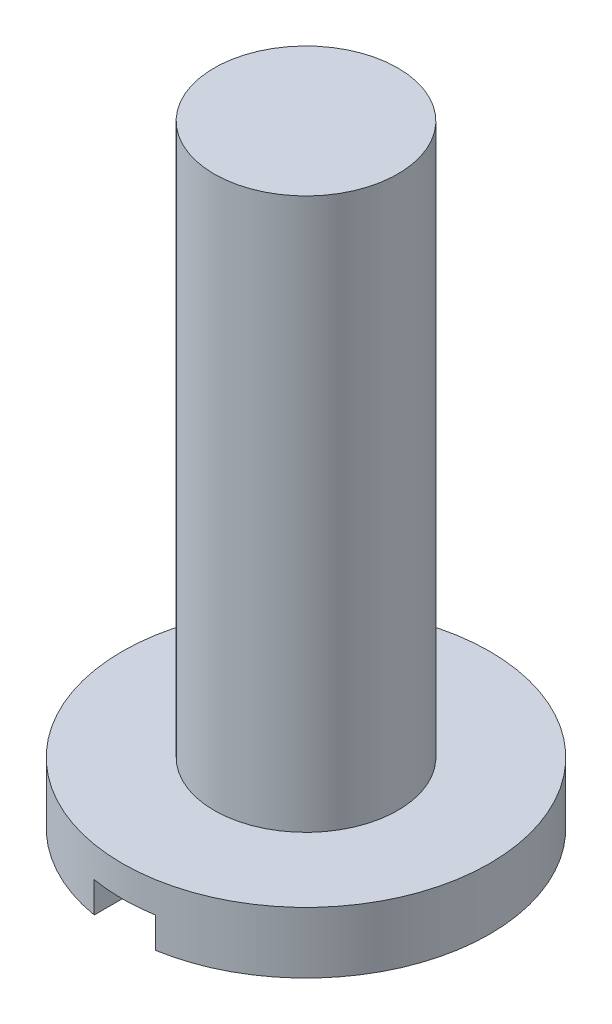
ISO-10303-21;
HEADER;
FILE_DESCRIPTION(('STEP AP214'),'2;1');
FILE_NAME('part.step','',(''),(''),'','','');
FILE_SCHEMA(('AUTOMOTIVE_DESIGN { 1 0 10303 214 1 1 1 1 }'));
ENDSEC;
DATA;
#1=APPLICATION_CONTEXT('core data for automotive mechanical design processes');
#2=APPLICATION_PROTOCOL_DEFINITION('international standard','automotive_design',2000,#1);
#3=PRODUCT_CONTEXT('',#1,'mechanical');
#4=PRODUCT('Part','Part','',(#3));
#5=PRODUCT_RELATED_PRODUCT_CATEGORY('part','',(#4));
#6=PRODUCT_DEFINITION_FORMATION('','',#4);
#7=PRODUCT_DEFINITION_CONTEXT('part definition',#1,'design');
#8=PRODUCT_DEFINITION('design','',#6,#7);
#9=PRODUCT_DEFINITION_SHAPE('','',#8);
#10=(LENGTH_UNIT() NAMED_UNIT(*) SI_UNIT(.MILLI.,.METRE.));
#11=(NAMED_UNIT(*) PLANE_ANGLE_UNIT() SI_UNIT($,.RADIAN.));
#12=(NAMED_UNIT(*) SI_UNIT($,.STERADIAN.) SOLID_ANGLE_UNIT());
#13=UNCERTAINTY_MEASURE_WITH_UNIT(LENGTH_MEASURE(1.E-05),#10,'distance_accuracy_value','');
#14=(GEOMETRIC_REPRESENTATION_CONTEXT(3) GLOBAL_UNCERTAINTY_ASSIGNED_CONTEXT((#13)) GLOBAL_UNIT_ASSIGNED_CONTEXT((#10,
#11,#12)) REPRESENTATION_CONTEXT('',''));
#15=CARTESIAN_POINT('',(0.,0.,0.));
#16=DIRECTION('',(0.,0.,1.));
#17=DIRECTION('',(1.,0.,0.));
#18=AXIS2_PLACEMENT_3D('',#15,#16,#17);
#19=CARTESIAN_POINT('',(0.,0.,0.));
#20=DIRECTION('',(0.,-1.,0.));
#21=DIRECTION('',(0.,0.,-1.));
#22=AXIS2_PLACEMENT_3D('',#19,#20,#21);
#23=PLANE('',#22);
#24=DIRECTION('',(0.,0.,-1.));
#25=VECTOR('',#24,1.);
#26=CARTESIAN_POINT('',(-0.500000000000001,0.,3.));
#27=LINE('',#26,#25);
#28=CARTESIAN_POINT('',(-0.500000000000001,0.,2.95803989154981));
#29=VERTEX_POINT('',#28);
#30=CARTESIAN_POINT('',(-0.5,0.,-2.95803989154981));
#31=VERTEX_POINT('',#30);
#32=EDGE_CURVE('E74',#29,#31,#27,.T.);
#33=ORIENTED_EDGE('',*,*,#32,.F.);
#34=CARTESIAN_POINT('',(0.,0.,0.));
#35=DIRECTION('',(0.,-1.,0.));
#36=DIRECTION('',(0.,0.,-1.));
#37=AXIS2_PLACEMENT_3D('',#34,#35,#36);
#38=CIRCLE('',#37,3.);
#39=EDGE_CURVE('E82',#29,#31,#38,.T.);
#40=ORIENTED_EDGE('',*,*,#39,.T.);
#41=EDGE_LOOP('',(#33,#40));
#42=FACE_BOUND('',#41,.T.);
#43=ADVANCED_FACE('F32',(#42),#23,.T.);
#44=DIRECTION('',(0.,0.,1.));
#45=VECTOR('',#44,1.);
#46=CARTESIAN_POINT('',(0.5,0.,3.));
#47=LINE('',#46,#45);
#48=CARTESIAN_POINT('',(0.5,0.,-2.95803989154981));
#49=VERTEX_POINT('',#48);
#50=CARTESIAN_POINT('',(0.5,0.,2.95803989154981));
#51=VERTEX_POINT('',#50);
#52=EDGE_CURVE('E83',#49,#51,#47,.T.);
#53=ORIENTED_EDGE('',*,*,#52,.F.);
#54=EDGE_CURVE('E88',#49,#51,#38,.T.);
#55=ORIENTED_EDGE('',*,*,#54,.T.);
#56=EDGE_LOOP('',(#53,#55));
#57=FACE_BOUND('',#56,.T.);
#58=ADVANCED_FACE('F34',(#57),#23,.T.);
#59=CARTESIAN_POINT('',(0.,0.,0.));
#60=DIRECTION('',(0.,-1.,0.));
#61=DIRECTION('',(0.,0.,-1.));
#62=AXIS2_PLACEMENT_3D('',#59,#60,#61);
#63=CYLINDRICAL_SURFACE('',#62,3.);
#64=DIRECTION('',(0.,-1.,0.));
#65=VECTOR('',#64,1.);
#66=CARTESIAN_POINT('',(-0.500000000000001,0.,2.95803989154981));
#67=LINE('',#66,#65);
#68=CARTESIAN_POINT('',(-0.500000000000001,0.5,2.95803989154981));
#69=VERTEX_POINT('',#68);
#70=EDGE_CURVE('E11',#69,#29,#67,.T.);
#71=ORIENTED_EDGE('',*,*,#70,.F.);
#72=CARTESIAN_POINT('',(0.,0.5,0.));
#73=DIRECTION('',(0.,-1.,0.));
#74=DIRECTION('',(0.,0.,-1.));
#75=AXIS2_PLACEMENT_3D('',#72,#73,#74);
#76=CIRCLE('',#75,3.);
#77=CARTESIAN_POINT('',(0.5,0.5,2.95803989154981));
#78=VERTEX_POINT('',#77);
#79=EDGE_CURVE('E99',#69,#78,#76,.F.);
#80=ORIENTED_EDGE('',*,*,#79,.T.);
#81=DIRECTION('',(0.,-1.,0.));
#82=VECTOR('',#81,1.);
#83=CARTESIAN_POINT('',(0.5,0.,2.95803989154981));
#84=LINE('',#83,#82);
#85=EDGE_CURVE('E40',#51,#78,#84,.F.);
#86=ORIENTED_EDGE('',*,*,#85,.F.);
#87=ORIENTED_EDGE('',*,*,#54,.F.);
#88=DIRECTION('',(0.,-1.,0.));
#89=VECTOR('',#88,1.);
#90=CARTESIAN_POINT('',(0.5,0.,-2.95803989154981));
#91=LINE('',#90,#89);
#92=CARTESIAN_POINT('',(0.5,0.5,-2.95803989154981));
#93=VERTEX_POINT('',#92);
#94=EDGE_CURVE('E98',#93,#49,#91,.T.);
#95=ORIENTED_EDGE('',*,*,#94,.F.);
#96=CARTESIAN_POINT('',(-0.5,0.5,-2.95803989154981));
#97=VERTEX_POINT('',#96);
#98=EDGE_CURVE('E53',#93,#97,#76,.F.);
#99=ORIENTED_EDGE('',*,*,#98,.T.);
#100=DIRECTION('',(0.,-1.,0.));
#101=VECTOR('',#100,1.);
#102=CARTESIAN_POINT('',(-0.5,0.,-2.95803989154981));
#103=LINE('',#102,#101);
#104=EDGE_CURVE('E87',#31,#97,#103,.F.);
#105=ORIENTED_EDGE('',*,*,#104,.F.);
#106=ORIENTED_EDGE('',*,*,#39,.F.);
#107=EDGE_LOOP('',(#71,#80,#86,#87,#95,#99,#105,#106));
#108=FACE_BOUND('',#107,.T.);
#109=CARTESIAN_POINT('',(0.,1.,0.));
#110=DIRECTION('',(0.,-1.,0.));
#111=DIRECTION('',(0.,0.,-1.));
#112=AXIS2_PLACEMENT_3D('',#109,#110,#111);
#113=CIRCLE('',#112,3.);
#114=CARTESIAN_POINT('',(0.,1.,-3.));
#115=VERTEX_POINT('',#114);
#116=EDGE_CURVE('E89',#115,#115,#113,.T.);
#117=ORIENTED_EDGE('',*,*,#116,.T.);
#118=EDGE_LOOP('',(#117));
#119=FACE_BOUND('',#118,.T.);
#120=ADVANCED_FACE('F85',(#108,#119),#63,.T.);
#121=CARTESIAN_POINT('',(3.,1.,0.));
#122=DIRECTION('',(0.,1.,0.));
#123=DIRECTION('',(0.,0.,1.));
#124=AXIS2_PLACEMENT_3D('',#121,#122,#123);
#125=PLANE('',#124);
#126=CARTESIAN_POINT('',(0.,1.,0.));
#127=DIRECTION('',(0.,-1.,0.));
#128=DIRECTION('',(0.,0.,-1.));
#129=AXIS2_PLACEMENT_3D('',#126,#127,#128);
#130=CIRCLE('',#129,1.5);
#131=CARTESIAN_POINT('',(0.,1.,-1.5));
#132=VERTEX_POINT('',#131);
#133=EDGE_CURVE('E93',#132,#132,#130,.T.);
#134=ORIENTED_EDGE('',*,*,#133,.T.);
#135=EDGE_LOOP('',(#134));
#136=FACE_BOUND('',#135,.T.);
#137=ORIENTED_EDGE('',*,*,#116,.F.);
#138=EDGE_LOOP('',(#137));
#139=FACE_BOUND('',#138,.T.);
#140=ADVANCED_FACE('F114',(#136,#139),#125,.T.);
#141=CARTESIAN_POINT('',(0.,0.,0.));
#142=DIRECTION('',(0.,-1.,0.));
#143=DIRECTION('',(0.,0.,-1.));
#144=AXIS2_PLACEMENT_3D('',#141,#142,#143);
#145=CYLINDRICAL_SURFACE('',#144,1.5);
#146=CARTESIAN_POINT('',(0.,10.,0.));
#147=DIRECTION('',(0.,-1.,0.));
#148=DIRECTION('',(0.,0.,-1.));
#149=AXIS2_PLACEMENT_3D('',#146,#147,#148);
#150=CIRCLE('',#149,1.5);
#151=CARTESIAN_POINT('',(0.,10.,-1.5));
#152=VERTEX_POINT('',#151);
#153=EDGE_CURVE('E105',#152,#152,#150,.T.);
#154=ORIENTED_EDGE('',*,*,#153,.T.);
#155=EDGE_LOOP('',(#154));
#156=FACE_BOUND('',#155,.T.);
#157=ORIENTED_EDGE('',*,*,#133,.F.);
#158=EDGE_LOOP('',(#157));
#159=FACE_BOUND('',#158,.T.);
#160=ADVANCED_FACE('F117',(#156,#159),#145,.T.);
#161=CARTESIAN_POINT('',(1.5,10.,0.));
#162=DIRECTION('',(0.,1.,0.));
#163=DIRECTION('',(0.,0.,1.));
#164=AXIS2_PLACEMENT_3D('',#161,#162,#163);
#165=PLANE('',#164);
#166=ORIENTED_EDGE('',*,*,#153,.F.);
#167=EDGE_LOOP('',(#166));
#168=FACE_BOUND('',#167,.T.);
#169=ADVANCED_FACE('F119',(#168),#165,.T.);
#170=CARTESIAN_POINT('',(-0.500000000000001,0.5,3.));
#171=DIRECTION('',(-1.,0.,0.));
#172=DIRECTION('',(0.,0.,1.));
#173=AXIS2_PLACEMENT_3D('',#170,#171,#172);
#174=PLANE('',#173);
#175=ORIENTED_EDGE('',*,*,#104,.T.);
#176=DIRECTION('',(0.,0.,-1.));
#177=VECTOR('',#176,1.);
#178=CARTESIAN_POINT('',(-0.500000000000001,0.5,3.));
#179=LINE('',#178,#177);
#180=EDGE_CURVE('E76',#69,#97,#179,.T.);
#181=ORIENTED_EDGE('',*,*,#180,.F.);
#182=ORIENTED_EDGE('',*,*,#70,.T.);
#183=ORIENTED_EDGE('',*,*,#32,.T.);
#184=EDGE_LOOP('',(#175,#181,#182,#183));
#185=FACE_BOUND('',#184,.T.);
#186=ADVANCED_FACE('F73',(#185),#174,.F.);
#187=CARTESIAN_POINT('',(0.5,0.5,3.));
#188=DIRECTION('',(1.,0.,0.));
#189=DIRECTION('',(0.,0.,-1.));
#190=AXIS2_PLACEMENT_3D('',#187,#188,#189);
#191=PLANE('',#190);
#192=ORIENTED_EDGE('',*,*,#85,.T.);
#193=DIRECTION('',(0.,0.,1.));
#194=VECTOR('',#193,1.);
#195=CARTESIAN_POINT('',(0.5,0.5,3.));
#196=LINE('',#195,#194);
#197=EDGE_CURVE('E103',#93,#78,#196,.T.);
#198=ORIENTED_EDGE('',*,*,#197,.F.);
#199=ORIENTED_EDGE('',*,*,#94,.T.);
#200=ORIENTED_EDGE('',*,*,#52,.T.);
#201=EDGE_LOOP('',(#192,#198,#199,#200));
#202=FACE_BOUND('',#201,.T.);
#203=ADVANCED_FACE('F138',(#202),#191,.F.);
#204=CARTESIAN_POINT('',(-0.5,0.5,-3.));
#205=DIRECTION('',(0.,-1.,0.));
#206=DIRECTION('',(0.,0.,-1.));
#207=AXIS2_PLACEMENT_3D('',#204,#205,#206);
#208=PLANE('',#207);
#209=ORIENTED_EDGE('',*,*,#180,.T.);
#210=ORIENTED_EDGE('',*,*,#98,.F.);
#211=ORIENTED_EDGE('',*,*,#197,.T.);
#212=ORIENTED_EDGE('',*,*,#79,.F.);
#213=EDGE_LOOP('',(#209,#210,#211,#212));
#214=FACE_BOUND('',#213,.T.);
#215=ADVANCED_FACE('F102',(#214),#208,.T.);
#216=CLOSED_SHELL('',(#43,#58,#120,#140,#160,#169,#186,#203,#215));
#217=MANIFOLD_SOLID_BREP('B2',#216);
#218=ADVANCED_BREP_SHAPE_REPRESENTATION('',(#18,#217),#14);
#219=SHAPE_DEFINITION_REPRESENTATION(#9,#218);
ENDSEC;
END-ISO-10303-21;
